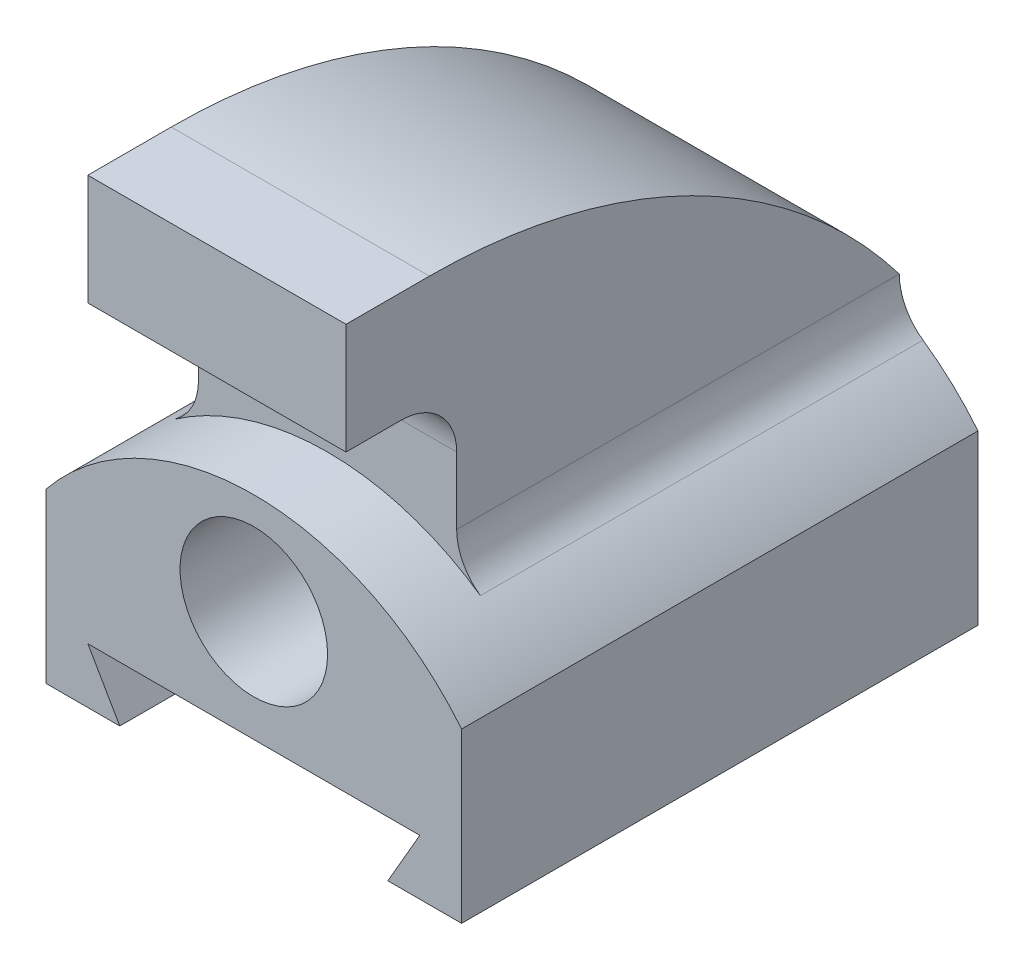
ISO-10303-21;
HEADER;
FILE_DESCRIPTION(('STEP AP214'),'2;1');
FILE_NAME('part.step','',(''),(''),'','','');
FILE_SCHEMA(('AUTOMOTIVE_DESIGN { 1 0 10303 214 1 1 1 1 }'));
ENDSEC;
DATA;
#1=APPLICATION_CONTEXT('core data for automotive mechanical design processes');
#2=APPLICATION_PROTOCOL_DEFINITION('international standard','automotive_design',2000,#1);
#3=PRODUCT_CONTEXT('',#1,'mechanical');
#4=PRODUCT('Part','Part','',(#3));
#5=PRODUCT_RELATED_PRODUCT_CATEGORY('part','',(#4));
#6=PRODUCT_DEFINITION_FORMATION('','',#4);
#7=PRODUCT_DEFINITION_CONTEXT('part definition',#1,'design');
#8=PRODUCT_DEFINITION('design','',#6,#7);
#9=PRODUCT_DEFINITION_SHAPE('','',#8);
#10=(LENGTH_UNIT() NAMED_UNIT(*) SI_UNIT(.MILLI.,.METRE.));
#11=(NAMED_UNIT(*) PLANE_ANGLE_UNIT() SI_UNIT($,.RADIAN.));
#12=(NAMED_UNIT(*) SI_UNIT($,.STERADIAN.) SOLID_ANGLE_UNIT());
#13=UNCERTAINTY_MEASURE_WITH_UNIT(LENGTH_MEASURE(1.E-05),#10,'distance_accuracy_value','');
#14=(GEOMETRIC_REPRESENTATION_CONTEXT(3) GLOBAL_UNCERTAINTY_ASSIGNED_CONTEXT((#13)) GLOBAL_UNIT_ASSIGNED_CONTEXT((#10,
#11,#12)) REPRESENTATION_CONTEXT('',''));
#15=CARTESIAN_POINT('',(0.,0.,0.));
#16=DIRECTION('',(0.,0.,1.));
#17=DIRECTION('',(1.,0.,0.));
#18=AXIS2_PLACEMENT_3D('',#15,#16,#17);
#19=CARTESIAN_POINT('',(0.,-9.525,-44.45));
#20=DIRECTION('',(0.,0.,1.));
#21=DIRECTION('',(1.,0.,0.));
#22=AXIS2_PLACEMENT_3D('',#19,#20,#21);
#23=PLANE('',#22);
#24=CARTESIAN_POINT('',(0.,19.05,-44.45));
#25=DIRECTION('',(0.,0.,1.));
#26=DIRECTION('',(1.,0.,0.));
#27=AXIS2_PLACEMENT_3D('',#24,#25,#26);
#28=CIRCLE('',#27,12.7);
#29=CARTESIAN_POINT('',(12.7,19.05,-44.45));
#30=VERTEX_POINT('',#29);
#31=EDGE_CURVE('E194',#30,#30,#28,.T.);
#32=ORIENTED_EDGE('',*,*,#31,.T.);
#33=EDGE_LOOP('',(#32));
#34=FACE_BOUND('',#33,.T.);
#35=DIRECTION('',(1.,0.,0.));
#36=VECTOR('',#35,1.);
#37=CARTESIAN_POINT('',(-35.7757386859688,36.0724660068956,-44.45));
#38=LINE('',#37,#36);
#39=CARTESIAN_POINT('',(-22.225,36.0724660068956,-44.45));
#40=VERTEX_POINT('',#39);
#41=CARTESIAN_POINT('',(22.225,36.0724660068956,-44.45));
#42=VERTEX_POINT('',#41);
#43=EDGE_CURVE('E154',#40,#42,#38,.T.);
#44=ORIENTED_EDGE('',*,*,#43,.T.);
#45=CARTESIAN_POINT('',(31.75,36.0724660068956,-44.45));
#46=DIRECTION('',(0.,0.,-1.));
#47=DIRECTION('',(-1.,0.,0.));
#48=AXIS2_PLACEMENT_3D('',#45,#46,#47);
#49=CIRCLE('',#48,9.525);
#50=CARTESIAN_POINT('',(26.3071428571429,28.2557575485706,-44.45));
#51=VERTEX_POINT('',#50);
#52=EDGE_CURVE('E167',#42,#51,#49,.F.);
#53=ORIENTED_EDGE('',*,*,#52,.T.);
#54=CARTESIAN_POINT('',(0.,-9.525,-44.45));
#55=DIRECTION('',(0.,0.,1.));
#56=DIRECTION('',(1.,0.,0.));
#57=AXIS2_PLACEMENT_3D('',#54,#55,#56);
#58=CIRCLE('',#57,46.0375);
#59=CARTESIAN_POINT('',(35.7757386859688,19.4499534550666,-44.45));
#60=VERTEX_POINT('',#59);
#61=EDGE_CURVE('E237',#60,#51,#58,.T.);
#62=ORIENTED_EDGE('',*,*,#61,.F.);
#63=DIRECTION('',(0.,1.,0.));
#64=VECTOR('',#63,1.);
#65=CARTESIAN_POINT('',(35.7757386859688,-9.525,-44.45));
#66=LINE('',#65,#64);
#67=CARTESIAN_POINT('',(35.7757386859688,-9.525,-44.45));
#68=VERTEX_POINT('',#67);
#69=EDGE_CURVE('E234',#68,#60,#66,.T.);
#70=ORIENTED_EDGE('',*,*,#69,.F.);
#71=DIRECTION('',(1.,0.,0.));
#72=VECTOR('',#71,1.);
#73=CARTESIAN_POINT('',(28.575,-9.525,-44.45));
#74=LINE('',#73,#72);
#75=CARTESIAN_POINT('',(23.0757386859688,-9.525,-44.45));
#76=VERTEX_POINT('',#75);
#77=EDGE_CURVE('E232',#76,#68,#74,.T.);
#78=ORIENTED_EDGE('',*,*,#77,.F.);
#79=DIRECTION('',(-0.500000000000004,-0.866025403784436,0.));
#80=VECTOR('',#79,1.);
#81=CARTESIAN_POINT('',(28.575,0.,-44.45));
#82=LINE('',#81,#80);
#83=CARTESIAN_POINT('',(28.575,0.,-44.45));
#84=VERTEX_POINT('',#83);
#85=EDGE_CURVE('E208',#84,#76,#82,.T.);
#86=ORIENTED_EDGE('',*,*,#85,.F.);
#87=DIRECTION('',(1.,0.,0.));
#88=VECTOR('',#87,1.);
#89=CARTESIAN_POINT('',(-28.575,0.,-44.45));
#90=LINE('',#89,#88);
#91=CARTESIAN_POINT('',(-28.575,0.,-44.45));
#92=VERTEX_POINT('',#91);
#93=EDGE_CURVE('E215',#92,#84,#90,.T.);
#94=ORIENTED_EDGE('',*,*,#93,.F.);
#95=DIRECTION('',(-0.500000000000004,0.866025403784436,0.));
#96=VECTOR('',#95,1.);
#97=CARTESIAN_POINT('',(-28.575,0.,-44.45));
#98=LINE('',#97,#96);
#99=CARTESIAN_POINT('',(-23.0757386859688,-9.52499999999999,-44.45));
#100=VERTEX_POINT('',#99);
#101=EDGE_CURVE('E244',#100,#92,#98,.T.);
#102=ORIENTED_EDGE('',*,*,#101,.F.);
#103=DIRECTION('',(1.,0.,0.));
#104=VECTOR('',#103,1.);
#105=CARTESIAN_POINT('',(-23.0757386859688,-9.52499999999999,-44.45));
#106=LINE('',#105,#104);
#107=CARTESIAN_POINT('',(-35.7757386859688,-9.52499999999999,-44.45));
#108=VERTEX_POINT('',#107);
#109=EDGE_CURVE('E242',#108,#100,#106,.T.);
#110=ORIENTED_EDGE('',*,*,#109,.F.);
#111=DIRECTION('',(0.,-1.,0.));
#112=VECTOR('',#111,1.);
#113=CARTESIAN_POINT('',(-35.7757386859688,-9.52499999999999,-44.45));
#114=LINE('',#113,#112);
#115=CARTESIAN_POINT('',(-35.7757386859688,19.4499534550666,-44.45));
#116=VERTEX_POINT('',#115);
#117=EDGE_CURVE('E239',#116,#108,#114,.T.);
#118=ORIENTED_EDGE('',*,*,#117,.F.);
#119=CARTESIAN_POINT('',(-26.3071428571429,28.2557575485706,-44.45));
#120=VERTEX_POINT('',#119);
#121=EDGE_CURVE('E236',#120,#116,#58,.T.);
#122=ORIENTED_EDGE('',*,*,#121,.F.);
#123=CARTESIAN_POINT('',(-31.75,36.0724660068956,-44.45));
#124=DIRECTION('',(0.,0.,-1.));
#125=DIRECTION('',(-1.,0.,0.));
#126=AXIS2_PLACEMENT_3D('',#123,#124,#125);
#127=CIRCLE('',#126,9.525);
#128=EDGE_CURVE('E169',#40,#120,#127,.T.);
#129=ORIENTED_EDGE('',*,*,#128,.F.);
#130=EDGE_LOOP('',(#44,#53,#62,#70,#78,#86,#94,#102,#110,#118,#122,#129));
#131=FACE_BOUND('',#130,.T.);
#132=ADVANCED_FACE('F35',(#34,#131),#23,.F.);
#133=CARTESIAN_POINT('',(22.225,0.,31.75));
#134=DIRECTION('',(-1.,0.,0.));
#135=DIRECTION('',(0.,0.,1.));
#136=AXIS2_PLACEMENT_3D('',#133,#134,#135);
#137=PLANE('',#136);
#138=CARTESIAN_POINT('',(22.225,-25.4,36.4431141879892));
#139=DIRECTION('',(1.,0.,0.));
#140=DIRECTION('',(0.,0.,-1.));
#141=AXIS2_PLACEMENT_3D('',#138,#139,#140);
#142=CIRCLE('',#141,101.6);
#143=CARTESIAN_POINT('',(22.225,76.2,36.4431141879892));
#144=VERTEX_POINT('',#143);
#145=EDGE_CURVE('E151',#42,#144,#142,.T.);
#146=ORIENTED_EDGE('',*,*,#145,.T.);
#147=DIRECTION('',(0.,0.,-1.));
#148=VECTOR('',#147,1.);
#149=CARTESIAN_POINT('',(22.225,76.2,31.75));
#150=LINE('',#149,#148);
#151=CARTESIAN_POINT('',(22.225,76.2,50.8));
#152=VERTEX_POINT('',#151);
#153=EDGE_CURVE('E192',#152,#144,#150,.T.);
#154=ORIENTED_EDGE('',*,*,#153,.F.);
#155=DIRECTION('',(0.,1.,0.));
#156=VECTOR('',#155,1.);
#157=CARTESIAN_POINT('',(22.225,0.,50.8));
#158=LINE('',#157,#156);
#159=CARTESIAN_POINT('',(22.225,57.15,50.8));
#160=VERTEX_POINT('',#159);
#161=EDGE_CURVE('E293',#160,#152,#158,.T.);
#162=ORIENTED_EDGE('',*,*,#161,.F.);
#163=DIRECTION('',(0.,0.,-1.));
#164=VECTOR('',#163,1.);
#165=CARTESIAN_POINT('',(22.225,57.15,50.8));
#166=LINE('',#165,#164);
#167=CARTESIAN_POINT('',(22.225,57.15,41.275));
#168=VERTEX_POINT('',#167);
#169=EDGE_CURVE('E184',#160,#168,#166,.T.);
#170=ORIENTED_EDGE('',*,*,#169,.T.);
#171=CARTESIAN_POINT('',(22.225,47.625,41.275));
#172=DIRECTION('',(-1.,0.,0.));
#173=DIRECTION('',(0.,0.,1.));
#174=AXIS2_PLACEMENT_3D('',#171,#172,#173);
#175=CIRCLE('',#174,9.525);
#176=CARTESIAN_POINT('',(22.225,47.625,31.75));
#177=VERTEX_POINT('',#176);
#178=EDGE_CURVE('E11',#168,#177,#175,.T.);
#179=ORIENTED_EDGE('',*,*,#178,.T.);
#180=DIRECTION('',(0.,1.,0.));
#181=VECTOR('',#180,1.);
#182=CARTESIAN_POINT('',(22.225,0.,31.75));
#183=LINE('',#182,#181);
#184=CARTESIAN_POINT('',(22.225,36.0724660068956,31.75));
#185=VERTEX_POINT('',#184);
#186=EDGE_CURVE('E175',#185,#177,#183,.T.);
#187=ORIENTED_EDGE('',*,*,#186,.F.);
#188=DIRECTION('',(0.,0.,-1.));
#189=VECTOR('',#188,1.);
#190=CARTESIAN_POINT('',(22.225,36.0724660068956,31.75));
#191=LINE('',#190,#189);
#192=EDGE_CURVE('E172',#185,#42,#191,.T.);
#193=ORIENTED_EDGE('',*,*,#192,.T.);
#194=EDGE_LOOP('',(#146,#154,#162,#170,#179,#187,#193));
#195=FACE_BOUND('',#194,.T.);
#196=ADVANCED_FACE('F173',(#195),#137,.F.);
#197=CARTESIAN_POINT('',(0.,76.2,31.75));
#198=DIRECTION('',(0.,-1.,0.));
#199=DIRECTION('',(1.,0.,0.));
#200=AXIS2_PLACEMENT_3D('',#197,#198,#199);
#201=PLANE('',#200);
#202=DIRECTION('',(1.,0.,0.));
#203=VECTOR('',#202,1.);
#204=CARTESIAN_POINT('',(-35.7757386859688,76.2,36.4431141879892));
#205=LINE('',#204,#203);
#206=CARTESIAN_POINT('',(-22.225,76.2,36.4431141879892));
#207=VERTEX_POINT('',#206);
#208=EDGE_CURVE('E157',#207,#144,#205,.T.);
#209=ORIENTED_EDGE('',*,*,#208,.F.);
#210=DIRECTION('',(0.,0.,-1.));
#211=VECTOR('',#210,1.);
#212=CARTESIAN_POINT('',(-22.225,76.2,31.75));
#213=LINE('',#212,#211);
#214=CARTESIAN_POINT('',(-22.225,76.2,50.8));
#215=VERTEX_POINT('',#214);
#216=EDGE_CURVE('E195',#215,#207,#213,.T.);
#217=ORIENTED_EDGE('',*,*,#216,.F.);
#218=DIRECTION('',(-1.,0.,0.));
#219=VECTOR('',#218,1.);
#220=CARTESIAN_POINT('',(0.,76.2,50.8));
#221=LINE('',#220,#219);
#222=EDGE_CURVE('E297',#152,#215,#221,.T.);
#223=ORIENTED_EDGE('',*,*,#222,.F.);
#224=ORIENTED_EDGE('',*,*,#153,.T.);
#225=EDGE_LOOP('',(#209,#217,#223,#224));
#226=FACE_BOUND('',#225,.T.);
#227=ADVANCED_FACE('F314',(#226),#201,.F.);
#228=CARTESIAN_POINT('',(-22.2250000000001,0.,31.75));
#229=DIRECTION('',(-1.,0.,0.));
#230=DIRECTION('',(0.,-1.,0.));
#231=AXIS2_PLACEMENT_3D('',#228,#229,#230);
#232=PLANE('',#231);
#233=ORIENTED_EDGE('',*,*,#216,.T.);
#234=CARTESIAN_POINT('',(-22.2250000000001,-25.4,36.4431141879892));
#235=DIRECTION('',(-1.,0.,0.));
#236=DIRECTION('',(0.,-1.,0.));
#237=AXIS2_PLACEMENT_3D('',#234,#235,#236);
#238=CIRCLE('',#237,101.6);
#239=EDGE_CURVE('E270',#207,#40,#238,.T.);
#240=ORIENTED_EDGE('',*,*,#239,.T.);
#241=DIRECTION('',(0.,0.,-1.));
#242=VECTOR('',#241,1.);
#243=CARTESIAN_POINT('',(-22.225,36.0724660068956,31.75));
#244=LINE('',#243,#242);
#245=CARTESIAN_POINT('',(-22.225,36.0724660068956,31.75));
#246=VERTEX_POINT('',#245);
#247=EDGE_CURVE('E198',#246,#40,#244,.T.);
#248=ORIENTED_EDGE('',*,*,#247,.F.);
#249=DIRECTION('',(0.,1.,0.));
#250=VECTOR('',#249,1.);
#251=CARTESIAN_POINT('',(-22.2250000000001,0.,31.75));
#252=LINE('',#251,#250);
#253=CARTESIAN_POINT('',(-22.225,47.625,31.75));
#254=VERTEX_POINT('',#253);
#255=EDGE_CURVE('E180',#246,#254,#252,.T.);
#256=ORIENTED_EDGE('',*,*,#255,.T.);
#257=CARTESIAN_POINT('',(-22.225,47.625,41.275));
#258=DIRECTION('',(-1.,0.,0.));
#259=DIRECTION('',(0.,-1.,0.));
#260=AXIS2_PLACEMENT_3D('',#257,#258,#259);
#261=CIRCLE('',#260,9.525);
#262=CARTESIAN_POINT('',(-22.225,57.15,41.275));
#263=VERTEX_POINT('',#262);
#264=EDGE_CURVE('E43',#254,#263,#261,.F.);
#265=ORIENTED_EDGE('',*,*,#264,.T.);
#266=DIRECTION('',(0.,0.,-1.));
#267=VECTOR('',#266,1.);
#268=CARTESIAN_POINT('',(-22.225,57.15,50.8));
#269=LINE('',#268,#267);
#270=CARTESIAN_POINT('',(-22.225,57.15,50.8));
#271=VERTEX_POINT('',#270);
#272=EDGE_CURVE('E187',#271,#263,#269,.T.);
#273=ORIENTED_EDGE('',*,*,#272,.F.);
#274=DIRECTION('',(0.,1.,0.));
#275=VECTOR('',#274,1.);
#276=CARTESIAN_POINT('',(-22.2250000000001,0.,50.8));
#277=LINE('',#276,#275);
#278=EDGE_CURVE('E300',#271,#215,#277,.T.);
#279=ORIENTED_EDGE('',*,*,#278,.T.);
#280=EDGE_LOOP('',(#233,#240,#248,#256,#265,#273,#279));
#281=FACE_BOUND('',#280,.T.);
#282=ADVANCED_FACE('F282',(#281),#232,.T.);
#283=CARTESIAN_POINT('',(0.,-9.525,44.45));
#284=DIRECTION('',(0.,0.,1.));
#285=DIRECTION('',(1.,0.,0.));
#286=AXIS2_PLACEMENT_3D('',#283,#284,#285);
#287=PLANE('',#286);
#288=DIRECTION('',(-0.500000000000004,-0.866025403784436,0.));
#289=VECTOR('',#288,1.);
#290=CARTESIAN_POINT('',(28.575,0.,44.45));
#291=LINE('',#290,#289);
#292=CARTESIAN_POINT('',(28.575,0.,44.45));
#293=VERTEX_POINT('',#292);
#294=CARTESIAN_POINT('',(23.0757386859688,-9.525,44.45));
#295=VERTEX_POINT('',#294);
#296=EDGE_CURVE('E211',#293,#295,#291,.T.);
#297=ORIENTED_EDGE('',*,*,#296,.T.);
#298=DIRECTION('',(1.,0.,0.));
#299=VECTOR('',#298,1.);
#300=CARTESIAN_POINT('',(23.0757386859688,-9.525,44.45));
#301=LINE('',#300,#299);
#302=CARTESIAN_POINT('',(35.7757386859688,-9.525,44.45));
#303=VERTEX_POINT('',#302);
#304=EDGE_CURVE('E214',#295,#303,#301,.T.);
#305=ORIENTED_EDGE('',*,*,#304,.T.);
#306=DIRECTION('',(0.,1.,0.));
#307=VECTOR('',#306,1.);
#308=CARTESIAN_POINT('',(35.7757386859688,-9.525,44.45));
#309=LINE('',#308,#307);
#310=CARTESIAN_POINT('',(35.7757386859688,19.4499534550666,44.45));
#311=VERTEX_POINT('',#310);
#312=EDGE_CURVE('E217',#303,#311,#309,.T.);
#313=ORIENTED_EDGE('',*,*,#312,.T.);
#314=CARTESIAN_POINT('',(0.,-9.525,44.45));
#315=DIRECTION('',(0.,0.,1.));
#316=DIRECTION('',(1.,0.,0.));
#317=AXIS2_PLACEMENT_3D('',#314,#315,#316);
#318=CIRCLE('',#317,46.0375);
#319=CARTESIAN_POINT('',(-35.7757386859688,19.4499534550666,44.45));
#320=VERTEX_POINT('',#319);
#321=EDGE_CURVE('E219',#311,#320,#318,.T.);
#322=ORIENTED_EDGE('',*,*,#321,.T.);
#323=DIRECTION('',(0.,-1.,0.));
#324=VECTOR('',#323,1.);
#325=CARTESIAN_POINT('',(-35.7757386859688,-9.52499999999999,44.45));
#326=LINE('',#325,#324);
#327=CARTESIAN_POINT('',(-35.7757386859688,-9.52499999999999,44.45));
#328=VERTEX_POINT('',#327);
#329=EDGE_CURVE('E221',#320,#328,#326,.T.);
#330=ORIENTED_EDGE('',*,*,#329,.T.);
#331=DIRECTION('',(1.,0.,0.));
#332=VECTOR('',#331,1.);
#333=CARTESIAN_POINT('',(-28.575,-9.52499999999999,44.45));
#334=LINE('',#333,#332);
#335=CARTESIAN_POINT('',(-23.0757386859688,-9.52499999999999,44.45));
#336=VERTEX_POINT('',#335);
#337=EDGE_CURVE('E223',#328,#336,#334,.T.);
#338=ORIENTED_EDGE('',*,*,#337,.T.);
#339=DIRECTION('',(-0.500000000000004,0.866025403784436,0.));
#340=VECTOR('',#339,1.);
#341=CARTESIAN_POINT('',(-28.575,0.,44.45));
#342=LINE('',#341,#340);
#343=CARTESIAN_POINT('',(-28.575,0.,44.45));
#344=VERTEX_POINT('',#343);
#345=EDGE_CURVE('E225',#336,#344,#342,.T.);
#346=ORIENTED_EDGE('',*,*,#345,.T.);
#347=DIRECTION('',(1.,0.,0.));
#348=VECTOR('',#347,1.);
#349=CARTESIAN_POINT('',(-28.575,0.,44.45));
#350=LINE('',#349,#348);
#351=EDGE_CURVE('E227',#344,#293,#350,.T.);
#352=ORIENTED_EDGE('',*,*,#351,.T.);
#353=EDGE_LOOP('',(#297,#305,#313,#322,#330,#338,#346,#352));
#354=FACE_BOUND('',#353,.T.);
#355=CARTESIAN_POINT('',(0.,19.05,44.45));
#356=DIRECTION('',(0.,0.,1.));
#357=DIRECTION('',(1.,0.,0.));
#358=AXIS2_PLACEMENT_3D('',#355,#356,#357);
#359=CIRCLE('',#358,12.7);
#360=CARTESIAN_POINT('',(12.7,19.05,44.45));
#361=VERTEX_POINT('',#360);
#362=EDGE_CURVE('E205',#361,#361,#359,.T.);
#363=ORIENTED_EDGE('',*,*,#362,.F.);
#364=EDGE_LOOP('',(#363));
#365=FACE_BOUND('',#364,.T.);
#366=ADVANCED_FACE('F329',(#354,#365),#287,.T.);
#367=CARTESIAN_POINT('',(28.575,0.,44.45));
#368=DIRECTION('',(0.866025403784436,-0.500000000000004,0.));
#369=DIRECTION('',(0.500000000000004,0.866025403784436,0.));
#370=AXIS2_PLACEMENT_3D('',#367,#368,#369);
#371=PLANE('',#370);
#372=ORIENTED_EDGE('',*,*,#85,.T.);
#373=DIRECTION('',(0.,0.,-1.));
#374=VECTOR('',#373,1.);
#375=CARTESIAN_POINT('',(23.0757386859688,-9.525,44.45));
#376=LINE('',#375,#374);
#377=EDGE_CURVE('E267',#295,#76,#376,.T.);
#378=ORIENTED_EDGE('',*,*,#377,.F.);
#379=ORIENTED_EDGE('',*,*,#296,.F.);
#380=DIRECTION('',(0.,0.,-1.));
#381=VECTOR('',#380,1.);
#382=CARTESIAN_POINT('',(28.575,0.,44.45));
#383=LINE('',#382,#381);
#384=EDGE_CURVE('E229',#293,#84,#383,.T.);
#385=ORIENTED_EDGE('',*,*,#384,.T.);
#386=EDGE_LOOP('',(#372,#378,#379,#385));
#387=FACE_BOUND('',#386,.T.);
#388=ADVANCED_FACE('F358',(#387),#371,.F.);
#389=CARTESIAN_POINT('',(28.575,-9.525,44.45));
#390=DIRECTION('',(0.,1.,0.));
#391=DIRECTION('',(-1.,0.,0.));
#392=AXIS2_PLACEMENT_3D('',#389,#390,#391);
#393=PLANE('',#392);
#394=ORIENTED_EDGE('',*,*,#77,.T.);
#395=DIRECTION('',(0.,0.,-1.));
#396=VECTOR('',#395,1.);
#397=CARTESIAN_POINT('',(35.7757386859688,-9.525,44.45));
#398=LINE('',#397,#396);
#399=EDGE_CURVE('E264',#303,#68,#398,.T.);
#400=ORIENTED_EDGE('',*,*,#399,.F.);
#401=ORIENTED_EDGE('',*,*,#304,.F.);
#402=ORIENTED_EDGE('',*,*,#377,.T.);
#403=EDGE_LOOP('',(#394,#400,#401,#402));
#404=FACE_BOUND('',#403,.T.);
#405=ADVANCED_FACE('F355',(#404),#393,.F.);
#406=CARTESIAN_POINT('',(35.7757386859688,-9.525,44.45));
#407=DIRECTION('',(-1.,0.,0.));
#408=DIRECTION('',(0.,-1.,0.));
#409=AXIS2_PLACEMENT_3D('',#406,#407,#408);
#410=PLANE('',#409);
#411=ORIENTED_EDGE('',*,*,#69,.T.);
#412=DIRECTION('',(0.,0.,-1.));
#413=VECTOR('',#412,1.);
#414=CARTESIAN_POINT('',(35.7757386859688,19.4499534550666,44.45));
#415=LINE('',#414,#413);
#416=EDGE_CURVE('E261',#311,#60,#415,.T.);
#417=ORIENTED_EDGE('',*,*,#416,.F.);
#418=ORIENTED_EDGE('',*,*,#312,.F.);
#419=ORIENTED_EDGE('',*,*,#399,.T.);
#420=EDGE_LOOP('',(#411,#417,#418,#419));
#421=FACE_BOUND('',#420,.T.);
#422=ADVANCED_FACE('F351',(#421),#410,.F.);
#423=CARTESIAN_POINT('',(0.,-9.525,44.45));
#424=DIRECTION('',(0.,0.,-1.));
#425=DIRECTION('',(-1.,0.,0.));
#426=AXIS2_PLACEMENT_3D('',#423,#424,#425);
#427=CYLINDRICAL_SURFACE('',#426,46.0375);
#428=CARTESIAN_POINT('',(0.,-9.525,31.75));
#429=DIRECTION('',(0.,0.,-1.));
#430=DIRECTION('',(-1.,0.,0.));
#431=AXIS2_PLACEMENT_3D('',#428,#429,#430);
#432=CIRCLE('',#431,46.0375);
#433=CARTESIAN_POINT('',(-26.3071428571429,28.2557575485707,31.75));
#434=VERTEX_POINT('',#433);
#435=CARTESIAN_POINT('',(26.3071428571429,28.2557575485706,31.75));
#436=VERTEX_POINT('',#435);
#437=EDGE_CURVE('E285',#434,#436,#432,.T.);
#438=ORIENTED_EDGE('',*,*,#437,.F.);
#439=DIRECTION('',(0.,0.,-1.));
#440=VECTOR('',#439,1.);
#441=CARTESIAN_POINT('',(-26.3071428571429,28.2557575485706,31.75));
#442=LINE('',#441,#440);
#443=EDGE_CURVE('E201',#434,#120,#442,.T.);
#444=ORIENTED_EDGE('',*,*,#443,.T.);
#445=ORIENTED_EDGE('',*,*,#121,.T.);
#446=DIRECTION('',(0.,0.,-1.));
#447=VECTOR('',#446,1.);
#448=CARTESIAN_POINT('',(-35.7757386859688,19.4499534550666,44.45));
#449=LINE('',#448,#447);
#450=EDGE_CURVE('E258',#320,#116,#449,.T.);
#451=ORIENTED_EDGE('',*,*,#450,.F.);
#452=ORIENTED_EDGE('',*,*,#321,.F.);
#453=ORIENTED_EDGE('',*,*,#416,.T.);
#454=ORIENTED_EDGE('',*,*,#61,.T.);
#455=DIRECTION('',(0.,0.,-1.));
#456=VECTOR('',#455,1.);
#457=CARTESIAN_POINT('',(26.3071428571429,28.2557575485706,31.75));
#458=LINE('',#457,#456);
#459=EDGE_CURVE('E179',#436,#51,#458,.T.);
#460=ORIENTED_EDGE('',*,*,#459,.F.);
#461=EDGE_LOOP('',(#438,#444,#445,#451,#452,#453,#454,#460));
#462=FACE_BOUND('',#461,.T.);
#463=ADVANCED_FACE('F347',(#462),#427,.T.);
#464=CARTESIAN_POINT('',(-35.7757386859688,-9.52499999999999,44.45));
#465=DIRECTION('',(1.,0.,0.));
#466=DIRECTION('',(0.,1.,0.));
#467=AXIS2_PLACEMENT_3D('',#464,#465,#466);
#468=PLANE('',#467);
#469=ORIENTED_EDGE('',*,*,#117,.T.);
#470=DIRECTION('',(0.,0.,-1.));
#471=VECTOR('',#470,1.);
#472=CARTESIAN_POINT('',(-35.7757386859688,-9.52499999999999,44.45));
#473=LINE('',#472,#471);
#474=EDGE_CURVE('E255',#328,#108,#473,.T.);
#475=ORIENTED_EDGE('',*,*,#474,.F.);
#476=ORIENTED_EDGE('',*,*,#329,.F.);
#477=ORIENTED_EDGE('',*,*,#450,.T.);
#478=EDGE_LOOP('',(#469,#475,#476,#477));
#479=FACE_BOUND('',#478,.T.);
#480=ADVANCED_FACE('F343',(#479),#468,.F.);
#481=CARTESIAN_POINT('',(-23.0757386859688,-9.52499999999999,44.45));
#482=DIRECTION('',(0.,1.,0.));
#483=DIRECTION('',(-1.,0.,0.));
#484=AXIS2_PLACEMENT_3D('',#481,#482,#483);
#485=PLANE('',#484);
#486=ORIENTED_EDGE('',*,*,#109,.T.);
#487=DIRECTION('',(0.,0.,-1.));
#488=VECTOR('',#487,1.);
#489=CARTESIAN_POINT('',(-23.0757386859688,-9.52499999999999,44.45));
#490=LINE('',#489,#488);
#491=EDGE_CURVE('E252',#336,#100,#490,.T.);
#492=ORIENTED_EDGE('',*,*,#491,.F.);
#493=ORIENTED_EDGE('',*,*,#337,.F.);
#494=ORIENTED_EDGE('',*,*,#474,.T.);
#495=EDGE_LOOP('',(#486,#492,#493,#494));
#496=FACE_BOUND('',#495,.T.);
#497=ADVANCED_FACE('F339',(#496),#485,.F.);
#498=CARTESIAN_POINT('',(-28.575,0.,44.45));
#499=DIRECTION('',(-0.866025403784436,-0.500000000000004,0.));
#500=DIRECTION('',(0.500000000000004,-0.866025403784436,0.));
#501=AXIS2_PLACEMENT_3D('',#498,#499,#500);
#502=PLANE('',#501);
#503=ORIENTED_EDGE('',*,*,#101,.T.);
#504=DIRECTION('',(0.,0.,-1.));
#505=VECTOR('',#504,1.);
#506=CARTESIAN_POINT('',(-28.575,0.,44.45));
#507=LINE('',#506,#505);
#508=EDGE_CURVE('E249',#344,#92,#507,.T.);
#509=ORIENTED_EDGE('',*,*,#508,.F.);
#510=ORIENTED_EDGE('',*,*,#345,.F.);
#511=ORIENTED_EDGE('',*,*,#491,.T.);
#512=EDGE_LOOP('',(#503,#509,#510,#511));
#513=FACE_BOUND('',#512,.T.);
#514=ADVANCED_FACE('F335',(#513),#502,.F.);
#515=CARTESIAN_POINT('',(-28.575,0.,44.45));
#516=DIRECTION('',(0.,1.,0.));
#517=DIRECTION('',(0.,0.,1.));
#518=AXIS2_PLACEMENT_3D('',#515,#516,#517);
#519=PLANE('',#518);
#520=ORIENTED_EDGE('',*,*,#93,.T.);
#521=ORIENTED_EDGE('',*,*,#384,.F.);
#522=ORIENTED_EDGE('',*,*,#351,.F.);
#523=ORIENTED_EDGE('',*,*,#508,.T.);
#524=EDGE_LOOP('',(#520,#521,#522,#523));
#525=FACE_BOUND('',#524,.T.);
#526=ADVANCED_FACE('F331',(#525),#519,.F.);
#527=CARTESIAN_POINT('',(0.,19.05,44.45));
#528=DIRECTION('',(0.,0.,-1.));
#529=DIRECTION('',(-1.,0.,0.));
#530=AXIS2_PLACEMENT_3D('',#527,#528,#529);
#531=CYLINDRICAL_SURFACE('',#530,12.7);
#532=ORIENTED_EDGE('',*,*,#362,.T.);
#533=EDGE_LOOP('',(#532));
#534=FACE_BOUND('',#533,.T.);
#535=ORIENTED_EDGE('',*,*,#31,.F.);
#536=EDGE_LOOP('',(#535));
#537=FACE_BOUND('',#536,.T.);
#538=ADVANCED_FACE('F334',(#534,#537),#531,.F.);
#539=CARTESIAN_POINT('',(-31.75,36.0724660068956,31.75));
#540=DIRECTION('',(0.,0.,-1.));
#541=DIRECTION('',(-1.,0.,0.));
#542=AXIS2_PLACEMENT_3D('',#539,#540,#541);
#543=CYLINDRICAL_SURFACE('',#542,9.525);
#544=ORIENTED_EDGE('',*,*,#128,.T.);
#545=ORIENTED_EDGE('',*,*,#443,.F.);
#546=CARTESIAN_POINT('',(-31.75,36.0724660068956,31.75));
#547=DIRECTION('',(0.,0.,-1.));
#548=DIRECTION('',(-1.,0.,0.));
#549=AXIS2_PLACEMENT_3D('',#546,#547,#548);
#550=CIRCLE('',#549,9.525);
#551=EDGE_CURVE('E284',#246,#434,#550,.T.);
#552=ORIENTED_EDGE('',*,*,#551,.F.);
#553=ORIENTED_EDGE('',*,*,#247,.T.);
#554=EDGE_LOOP('',(#544,#545,#552,#553));
#555=FACE_BOUND('',#554,.T.);
#556=ADVANCED_FACE('F388',(#555),#543,.F.);
#557=CARTESIAN_POINT('',(31.75,36.0724660068956,31.75));
#558=DIRECTION('',(0.,0.,-1.));
#559=DIRECTION('',(-1.,0.,0.));
#560=AXIS2_PLACEMENT_3D('',#557,#558,#559);
#561=CYLINDRICAL_SURFACE('',#560,9.525);
#562=ORIENTED_EDGE('',*,*,#52,.F.);
#563=ORIENTED_EDGE('',*,*,#192,.F.);
#564=CARTESIAN_POINT('',(31.75,36.0724660068956,31.75));
#565=DIRECTION('',(0.,0.,-1.));
#566=DIRECTION('',(-1.,0.,0.));
#567=AXIS2_PLACEMENT_3D('',#564,#565,#566);
#568=CIRCLE('',#567,9.525);
#569=EDGE_CURVE('E288',#185,#436,#568,.F.);
#570=ORIENTED_EDGE('',*,*,#569,.T.);
#571=ORIENTED_EDGE('',*,*,#459,.T.);
#572=EDGE_LOOP('',(#562,#563,#570,#571));
#573=FACE_BOUND('',#572,.T.);
#574=ADVANCED_FACE('F183',(#573),#561,.F.);
#575=CARTESIAN_POINT('',(0.,0.,31.75));
#576=DIRECTION('',(0.,0.,-1.));
#577=DIRECTION('',(-1.,0.,0.));
#578=AXIS2_PLACEMENT_3D('',#575,#576,#577);
#579=PLANE('',#578);
#580=ORIENTED_EDGE('',*,*,#186,.T.);
#581=DIRECTION('',(-1.,0.,0.));
#582=VECTOR('',#581,1.);
#583=CARTESIAN_POINT('',(0.,47.625,31.75));
#584=LINE('',#583,#582);
#585=EDGE_CURVE('E272',#177,#254,#584,.T.);
#586=ORIENTED_EDGE('',*,*,#585,.T.);
#587=ORIENTED_EDGE('',*,*,#255,.F.);
#588=ORIENTED_EDGE('',*,*,#551,.T.);
#589=ORIENTED_EDGE('',*,*,#437,.T.);
#590=ORIENTED_EDGE('',*,*,#569,.F.);
#591=EDGE_LOOP('',(#580,#586,#587,#588,#589,#590));
#592=FACE_BOUND('',#591,.T.);
#593=ADVANCED_FACE('F278',(#592),#579,.F.);
#594=CARTESIAN_POINT('',(0.,57.15,50.8));
#595=DIRECTION('',(0.,-1.,0.));
#596=DIRECTION('',(1.,0.,0.));
#597=AXIS2_PLACEMENT_3D('',#594,#595,#596);
#598=PLANE('',#597);
#599=ORIENTED_EDGE('',*,*,#272,.T.);
#600=DIRECTION('',(-1.,0.,0.));
#601=VECTOR('',#600,1.);
#602=CARTESIAN_POINT('',(0.,57.15,41.275));
#603=LINE('',#602,#601);
#604=EDGE_CURVE('E56',#263,#168,#603,.F.);
#605=ORIENTED_EDGE('',*,*,#604,.T.);
#606=ORIENTED_EDGE('',*,*,#169,.F.);
#607=DIRECTION('',(-1.,0.,0.));
#608=VECTOR('',#607,1.);
#609=CARTESIAN_POINT('',(0.,57.15,50.8));
#610=LINE('',#609,#608);
#611=EDGE_CURVE('E303',#160,#271,#610,.T.);
#612=ORIENTED_EDGE('',*,*,#611,.T.);
#613=EDGE_LOOP('',(#599,#605,#606,#612));
#614=FACE_BOUND('',#613,.T.);
#615=ADVANCED_FACE('F307',(#614),#598,.T.);
#616=CARTESIAN_POINT('',(0.,0.,50.8));
#617=DIRECTION('',(0.,0.,-1.));
#618=DIRECTION('',(-1.,0.,0.));
#619=AXIS2_PLACEMENT_3D('',#616,#617,#618);
#620=PLANE('',#619);
#621=ORIENTED_EDGE('',*,*,#611,.F.);
#622=ORIENTED_EDGE('',*,*,#161,.T.);
#623=ORIENTED_EDGE('',*,*,#222,.T.);
#624=ORIENTED_EDGE('',*,*,#278,.F.);
#625=EDGE_LOOP('',(#621,#622,#623,#624));
#626=FACE_BOUND('',#625,.T.);
#627=ADVANCED_FACE('F311',(#626),#620,.F.);
#628=CARTESIAN_POINT('',(-35.7757386859688,-25.4,36.4431141879892));
#629=DIRECTION('',(1.,0.,0.));
#630=DIRECTION('',(0.,0.,-1.));
#631=AXIS2_PLACEMENT_3D('',#628,#629,#630);
#632=CYLINDRICAL_SURFACE('',#631,101.6);
#633=ORIENTED_EDGE('',*,*,#208,.T.);
#634=ORIENTED_EDGE('',*,*,#145,.F.);
#635=ORIENTED_EDGE('',*,*,#43,.F.);
#636=ORIENTED_EDGE('',*,*,#239,.F.);
#637=EDGE_LOOP('',(#633,#634,#635,#636));
#638=FACE_BOUND('',#637,.T.);
#639=ADVANCED_FACE('F153',(#638),#632,.T.);
#640=CARTESIAN_POINT('',(0.,47.625,41.275));
#641=DIRECTION('',(-1.,0.,0.));
#642=DIRECTION('',(0.,-1.,0.));
#643=AXIS2_PLACEMENT_3D('',#640,#641,#642);
#644=CYLINDRICAL_SURFACE('',#643,9.525);
#645=ORIENTED_EDGE('',*,*,#178,.F.);
#646=ORIENTED_EDGE('',*,*,#604,.F.);
#647=ORIENTED_EDGE('',*,*,#264,.F.);
#648=ORIENTED_EDGE('',*,*,#585,.F.);
#649=EDGE_LOOP('',(#645,#646,#647,#648));
#650=FACE_BOUND('',#649,.T.);
#651=ADVANCED_FACE('F37',(#650),#644,.F.);
#652=CLOSED_SHELL('',(#132,#196,#227,#282,#366,#388,#405,#422,#463,#480,#497,#514,#526,#538,
#556,#574,#593,#615,#627,#639,#651));
#653=MANIFOLD_SOLID_BREP('B2',#652);
#654=ADVANCED_BREP_SHAPE_REPRESENTATION('',(#18,#653),#14);
#655=SHAPE_DEFINITION_REPRESENTATION(#9,#654);
ENDSEC;
END-ISO-10303-21;
